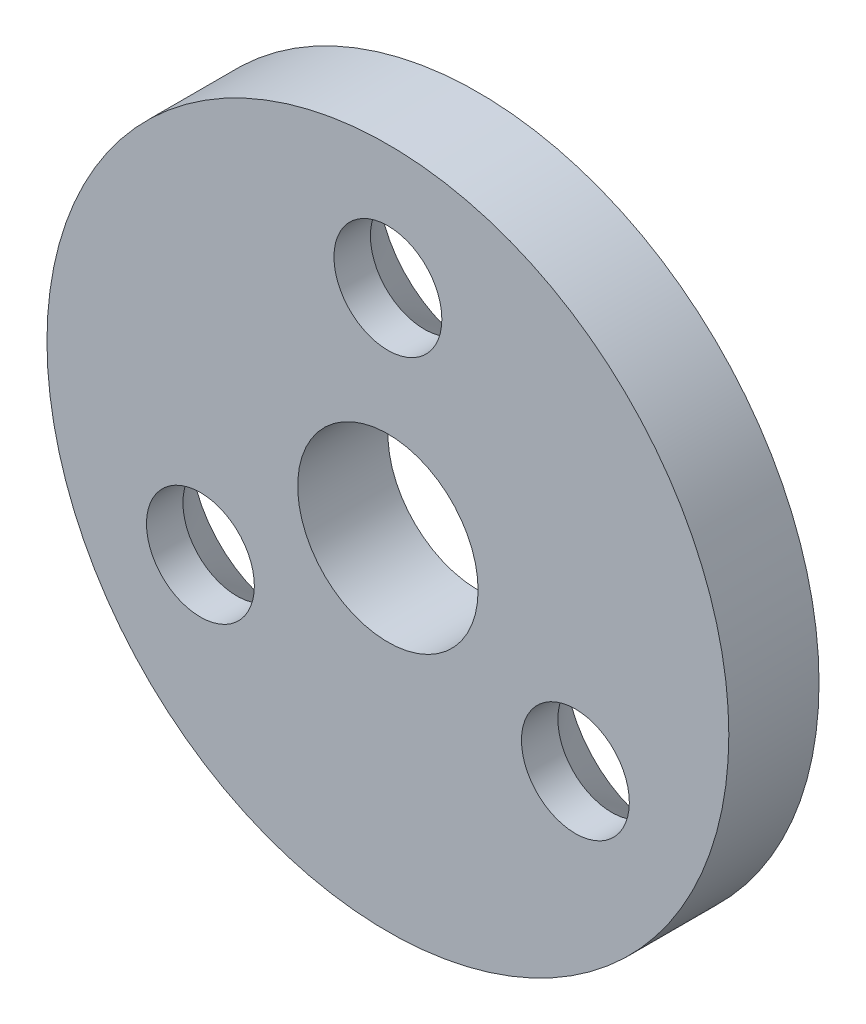
ISO-10303-21;
HEADER;
FILE_DESCRIPTION(('STEP AP214'),'2;1');
FILE_NAME('part.step','',(''),(''),'','','');
FILE_SCHEMA(('AUTOMOTIVE_DESIGN { 1 0 10303 214 1 1 1 1 }'));
ENDSEC;
DATA;
#1=APPLICATION_CONTEXT('core data for automotive mechanical design processes');
#2=APPLICATION_PROTOCOL_DEFINITION('international standard','automotive_design',2000,#1);
#3=PRODUCT_CONTEXT('',#1,'mechanical');
#4=PRODUCT('Part','Part','',(#3));
#5=PRODUCT_RELATED_PRODUCT_CATEGORY('part','',(#4));
#6=PRODUCT_DEFINITION_FORMATION('','',#4);
#7=PRODUCT_DEFINITION_CONTEXT('part definition',#1,'design');
#8=PRODUCT_DEFINITION('design','',#6,#7);
#9=PRODUCT_DEFINITION_SHAPE('','',#8);
#10=(LENGTH_UNIT() NAMED_UNIT(*) SI_UNIT(.MILLI.,.METRE.));
#11=(NAMED_UNIT(*) PLANE_ANGLE_UNIT() SI_UNIT($,.RADIAN.));
#12=(NAMED_UNIT(*) SI_UNIT($,.STERADIAN.) SOLID_ANGLE_UNIT());
#13=UNCERTAINTY_MEASURE_WITH_UNIT(LENGTH_MEASURE(1.E-05),#10,'distance_accuracy_value','');
#14=(GEOMETRIC_REPRESENTATION_CONTEXT(3) GLOBAL_UNCERTAINTY_ASSIGNED_CONTEXT((#13)) GLOBAL_UNIT_ASSIGNED_CONTEXT((#10,
#11,#12)) REPRESENTATION_CONTEXT('',''));
#15=CARTESIAN_POINT('',(0.,0.,0.));
#16=DIRECTION('',(0.,0.,1.));
#17=DIRECTION('',(1.,0.,0.));
#18=AXIS2_PLACEMENT_3D('',#15,#16,#17);
#19=CARTESIAN_POINT('',(0.,0.,0.));
#20=DIRECTION('',(0.,0.,1.));
#21=DIRECTION('',(1.,0.,0.));
#22=AXIS2_PLACEMENT_3D('',#19,#20,#21);
#23=PLANE('',#22);
#24=CARTESIAN_POINT('',(0.,7.62,0.));
#25=DIRECTION('',(0.,0.,-1.));
#26=DIRECTION('',(-1.,0.,0.));
#27=AXIS2_PLACEMENT_3D('',#24,#25,#26);
#28=CIRCLE('',#27,3.5433);
#29=CARTESIAN_POINT('',(-3.5433,7.62,0.));
#30=VERTEX_POINT('',#29);
#31=EDGE_CURVE('E102',#30,#30,#28,.T.);
#32=ORIENTED_EDGE('',*,*,#31,.F.);
#33=EDGE_LOOP('',(#32));
#34=FACE_BOUND('',#33,.T.);
#35=CARTESIAN_POINT('',(6.59911357683743,-3.80999999999998,0.));
#36=DIRECTION('',(0.,0.,-1.));
#37=DIRECTION('',(-1.,0.,0.));
#38=AXIS2_PLACEMENT_3D('',#35,#36,#37);
#39=CIRCLE('',#38,3.5433);
#40=CARTESIAN_POINT('',(3.05581357683743,-3.80999999999998,0.));
#41=VERTEX_POINT('',#40);
#42=EDGE_CURVE('E62',#41,#41,#39,.T.);
#43=ORIENTED_EDGE('',*,*,#42,.F.);
#44=EDGE_LOOP('',(#43));
#45=FACE_BOUND('',#44,.T.);
#46=CARTESIAN_POINT('',(0.,0.,0.));
#47=DIRECTION('',(0.,0.,1.));
#48=DIRECTION('',(1.,0.,0.));
#49=AXIS2_PLACEMENT_3D('',#46,#47,#48);
#50=CIRCLE('',#49,12.);
#51=CARTESIAN_POINT('',(12.,0.,0.));
#52=VERTEX_POINT('',#51);
#53=EDGE_CURVE('E39',#52,#52,#50,.T.);
#54=ORIENTED_EDGE('',*,*,#53,.F.);
#55=EDGE_LOOP('',(#54));
#56=FACE_BOUND('',#55,.T.);
#57=CARTESIAN_POINT('',(0.,0.,0.));
#58=DIRECTION('',(0.,0.,1.));
#59=DIRECTION('',(1.,0.,0.));
#60=AXIS2_PLACEMENT_3D('',#57,#58,#59);
#61=CIRCLE('',#60,3.175);
#62=CARTESIAN_POINT('',(3.175,0.,0.));
#63=VERTEX_POINT('',#62);
#64=EDGE_CURVE('E47',#63,#63,#61,.T.);
#65=ORIENTED_EDGE('',*,*,#64,.T.);
#66=EDGE_LOOP('',(#65));
#67=FACE_BOUND('',#66,.T.);
#68=CARTESIAN_POINT('',(-6.59911357683743,-3.80999999999998,0.));
#69=DIRECTION('',(0.,0.,-1.));
#70=DIRECTION('',(-1.,0.,0.));
#71=AXIS2_PLACEMENT_3D('',#68,#69,#70);
#72=CIRCLE('',#71,3.5433);
#73=CARTESIAN_POINT('',(-10.1424135768374,-3.80999999999998,0.));
#74=VERTEX_POINT('',#73);
#75=EDGE_CURVE('E55',#74,#74,#72,.T.);
#76=ORIENTED_EDGE('',*,*,#75,.F.);
#77=EDGE_LOOP('',(#76));
#78=FACE_BOUND('',#77,.T.);
#79=ADVANCED_FACE('F31',(#34,#45,#56,#67,#78),#23,.F.);
#80=CARTESIAN_POINT('',(0.,0.,3.175));
#81=DIRECTION('',(0.,0.,1.));
#82=DIRECTION('',(1.,0.,0.));
#83=AXIS2_PLACEMENT_3D('',#80,#81,#82);
#84=PLANE('',#83);
#85=CARTESIAN_POINT('',(0.,7.62,3.175));
#86=DIRECTION('',(0.,0.,1.));
#87=DIRECTION('',(1.,0.,0.));
#88=AXIS2_PLACEMENT_3D('',#85,#86,#87);
#89=CIRCLE('',#88,1.89865);
#90=CARTESIAN_POINT('',(1.89865,7.62,3.175));
#91=VERTEX_POINT('',#90);
#92=EDGE_CURVE('E35',#91,#91,#89,.T.);
#93=ORIENTED_EDGE('',*,*,#92,.F.);
#94=EDGE_LOOP('',(#93));
#95=FACE_BOUND('',#94,.T.);
#96=CARTESIAN_POINT('',(6.59911357683743,-3.80999999999998,3.175));
#97=DIRECTION('',(0.,0.,1.));
#98=DIRECTION('',(1.,0.,0.));
#99=AXIS2_PLACEMENT_3D('',#96,#97,#98);
#100=CIRCLE('',#99,1.89865);
#101=CARTESIAN_POINT('',(8.49776357683743,-3.80999999999998,3.175));
#102=VERTEX_POINT('',#101);
#103=EDGE_CURVE('E53',#102,#102,#100,.T.);
#104=ORIENTED_EDGE('',*,*,#103,.F.);
#105=EDGE_LOOP('',(#104));
#106=FACE_BOUND('',#105,.T.);
#107=CARTESIAN_POINT('',(-6.59911357683743,-3.80999999999998,3.175));
#108=DIRECTION('',(0.,0.,1.));
#109=DIRECTION('',(1.,0.,0.));
#110=AXIS2_PLACEMENT_3D('',#107,#108,#109);
#111=CIRCLE('',#110,1.89865);
#112=CARTESIAN_POINT('',(-4.70046357683743,-3.80999999999998,3.175));
#113=VERTEX_POINT('',#112);
#114=EDGE_CURVE('E50',#113,#113,#111,.T.);
#115=ORIENTED_EDGE('',*,*,#114,.F.);
#116=EDGE_LOOP('',(#115));
#117=FACE_BOUND('',#116,.T.);
#118=CARTESIAN_POINT('',(0.,0.,3.175));
#119=DIRECTION('',(0.,0.,1.));
#120=DIRECTION('',(1.,0.,0.));
#121=AXIS2_PLACEMENT_3D('',#118,#119,#120);
#122=CIRCLE('',#121,12.);
#123=CARTESIAN_POINT('',(12.,0.,3.175));
#124=VERTEX_POINT('',#123);
#125=EDGE_CURVE('E10',#124,#124,#122,.T.);
#126=ORIENTED_EDGE('',*,*,#125,.T.);
#127=EDGE_LOOP('',(#126));
#128=FACE_BOUND('',#127,.T.);
#129=CARTESIAN_POINT('',(0.,0.,3.175));
#130=DIRECTION('',(0.,0.,1.));
#131=DIRECTION('',(1.,0.,0.));
#132=AXIS2_PLACEMENT_3D('',#129,#130,#131);
#133=CIRCLE('',#132,3.175);
#134=CARTESIAN_POINT('',(3.175,0.,3.175));
#135=VERTEX_POINT('',#134);
#136=EDGE_CURVE('E44',#135,#135,#133,.T.);
#137=ORIENTED_EDGE('',*,*,#136,.F.);
#138=EDGE_LOOP('',(#137));
#139=FACE_BOUND('',#138,.T.);
#140=ADVANCED_FACE('F90',(#95,#106,#117,#128,#139),#84,.T.);
#141=CARTESIAN_POINT('',(0.,0.,3.175));
#142=DIRECTION('',(0.,0.,-1.));
#143=DIRECTION('',(-1.,0.,0.));
#144=AXIS2_PLACEMENT_3D('',#141,#142,#143);
#145=CYLINDRICAL_SURFACE('',#144,12.);
#146=ORIENTED_EDGE('',*,*,#125,.F.);
#147=EDGE_LOOP('',(#146));
#148=FACE_BOUND('',#147,.T.);
#149=ORIENTED_EDGE('',*,*,#53,.T.);
#150=EDGE_LOOP('',(#149));
#151=FACE_BOUND('',#150,.T.);
#152=ADVANCED_FACE('F33',(#148,#151),#145,.T.);
#153=CARTESIAN_POINT('',(0.,0.,3.175));
#154=DIRECTION('',(0.,0.,-1.));
#155=DIRECTION('',(-1.,0.,0.));
#156=AXIS2_PLACEMENT_3D('',#153,#154,#155);
#157=CYLINDRICAL_SURFACE('',#156,3.175);
#158=ORIENTED_EDGE('',*,*,#136,.T.);
#159=EDGE_LOOP('',(#158));
#160=FACE_BOUND('',#159,.T.);
#161=ORIENTED_EDGE('',*,*,#64,.F.);
#162=EDGE_LOOP('',(#161));
#163=FACE_BOUND('',#162,.T.);
#164=ADVANCED_FACE('F79',(#160,#163),#157,.F.);
#165=CARTESIAN_POINT('',(-6.59911357683743,-3.80999999999998,0.));
#166=DIRECTION('',(0.,0.,-1.));
#167=DIRECTION('',(-1.,0.,0.));
#168=AXIS2_PLACEMENT_3D('',#165,#166,#167);
#169=CYLINDRICAL_SURFACE('',#168,1.89865);
#170=ORIENTED_EDGE('',*,*,#114,.T.);
#171=EDGE_LOOP('',(#170));
#172=FACE_BOUND('',#171,.T.);
#173=CARTESIAN_POINT('',(-6.59911357683743,-3.80999999999998,1.89195340093603));
#174=DIRECTION('',(0.,0.,-1.));
#175=DIRECTION('',(-1.,0.,0.));
#176=AXIS2_PLACEMENT_3D('',#173,#174,#175);
#177=CIRCLE('',#176,1.89865);
#178=CARTESIAN_POINT('',(-8.49776357683743,-3.80999999999998,1.89195340093603));
#179=VERTEX_POINT('',#178);
#180=EDGE_CURVE('E52',#179,#179,#177,.T.);
#181=ORIENTED_EDGE('',*,*,#180,.T.);
#182=EDGE_LOOP('',(#181));
#183=FACE_BOUND('',#182,.T.);
#184=ADVANCED_FACE('F81',(#172,#183),#169,.F.);
#185=CARTESIAN_POINT('',(-6.59911357683743,-3.80999999999998,0.));
#186=DIRECTION('',(0.,0.,-1.));
#187=DIRECTION('',(-1.,0.,0.));
#188=AXIS2_PLACEMENT_3D('',#185,#186,#187);
#189=CONICAL_SURFACE('',#188,3.5433,0.715584993317675);
#190=ORIENTED_EDGE('',*,*,#180,.F.);
#191=EDGE_LOOP('',(#190));
#192=FACE_BOUND('',#191,.T.);
#193=ORIENTED_EDGE('',*,*,#75,.T.);
#194=EDGE_LOOP('',(#193));
#195=FACE_BOUND('',#194,.T.);
#196=ADVANCED_FACE('F87',(#192,#195),#189,.F.);
#197=CARTESIAN_POINT('',(6.59911357683743,-3.80999999999998,0.));
#198=DIRECTION('',(0.,0.,-1.));
#199=DIRECTION('',(-1.,0.,0.));
#200=AXIS2_PLACEMENT_3D('',#197,#198,#199);
#201=CYLINDRICAL_SURFACE('',#200,1.89865);
#202=ORIENTED_EDGE('',*,*,#103,.T.);
#203=EDGE_LOOP('',(#202));
#204=FACE_BOUND('',#203,.T.);
#205=CARTESIAN_POINT('',(6.59911357683743,-3.80999999999998,1.89195340093603));
#206=DIRECTION('',(0.,0.,-1.));
#207=DIRECTION('',(-1.,0.,0.));
#208=AXIS2_PLACEMENT_3D('',#205,#206,#207);
#209=CIRCLE('',#208,1.89865);
#210=CARTESIAN_POINT('',(4.70046357683743,-3.80999999999998,1.89195340093603));
#211=VERTEX_POINT('',#210);
#212=EDGE_CURVE('E56',#211,#211,#209,.T.);
#213=ORIENTED_EDGE('',*,*,#212,.T.);
#214=EDGE_LOOP('',(#213));
#215=FACE_BOUND('',#214,.T.);
#216=ADVANCED_FACE('F111',(#204,#215),#201,.F.);
#217=CARTESIAN_POINT('',(6.59911357683743,-3.80999999999998,0.));
#218=DIRECTION('',(0.,0.,-1.));
#219=DIRECTION('',(-1.,0.,0.));
#220=AXIS2_PLACEMENT_3D('',#217,#218,#219);
#221=CONICAL_SURFACE('',#220,3.5433,0.715584993317676);
#222=ORIENTED_EDGE('',*,*,#212,.F.);
#223=EDGE_LOOP('',(#222));
#224=FACE_BOUND('',#223,.T.);
#225=ORIENTED_EDGE('',*,*,#42,.T.);
#226=EDGE_LOOP('',(#225));
#227=FACE_BOUND('',#226,.T.);
#228=ADVANCED_FACE('F108',(#224,#227),#221,.F.);
#229=CARTESIAN_POINT('',(0.,7.62,0.));
#230=DIRECTION('',(0.,0.,-1.));
#231=DIRECTION('',(-1.,0.,0.));
#232=AXIS2_PLACEMENT_3D('',#229,#230,#231);
#233=CYLINDRICAL_SURFACE('',#232,1.89865);
#234=ORIENTED_EDGE('',*,*,#92,.T.);
#235=EDGE_LOOP('',(#234));
#236=FACE_BOUND('',#235,.T.);
#237=CARTESIAN_POINT('',(0.,7.62,1.89195340093603));
#238=DIRECTION('',(0.,0.,-1.));
#239=DIRECTION('',(-1.,0.,0.));
#240=AXIS2_PLACEMENT_3D('',#237,#238,#239);
#241=CIRCLE('',#240,1.89865);
#242=CARTESIAN_POINT('',(-1.89865,7.62,1.89195340093603));
#243=VERTEX_POINT('',#242);
#244=EDGE_CURVE('E163',#243,#243,#241,.T.);
#245=ORIENTED_EDGE('',*,*,#244,.T.);
#246=EDGE_LOOP('',(#245));
#247=FACE_BOUND('',#246,.T.);
#248=ADVANCED_FACE('F110',(#236,#247),#233,.F.);
#249=CARTESIAN_POINT('',(0.,7.62,0.));
#250=DIRECTION('',(0.,0.,-1.));
#251=DIRECTION('',(-1.,0.,0.));
#252=AXIS2_PLACEMENT_3D('',#249,#250,#251);
#253=CONICAL_SURFACE('',#252,3.5433,0.715584993317675);
#254=ORIENTED_EDGE('',*,*,#244,.F.);
#255=EDGE_LOOP('',(#254));
#256=FACE_BOUND('',#255,.T.);
#257=ORIENTED_EDGE('',*,*,#31,.T.);
#258=EDGE_LOOP('',(#257));
#259=FACE_BOUND('',#258,.T.);
#260=ADVANCED_FACE('F118',(#256,#259),#253,.F.);
#261=CLOSED_SHELL('',(#79,#140,#152,#164,#184,#196,#216,#228,#248,#260));
#262=MANIFOLD_SOLID_BREP('B2',#261);
#263=ADVANCED_BREP_SHAPE_REPRESENTATION('',(#18,#262),#14);
#264=SHAPE_DEFINITION_REPRESENTATION(#9,#263);
ENDSEC;
END-ISO-10303-21;
